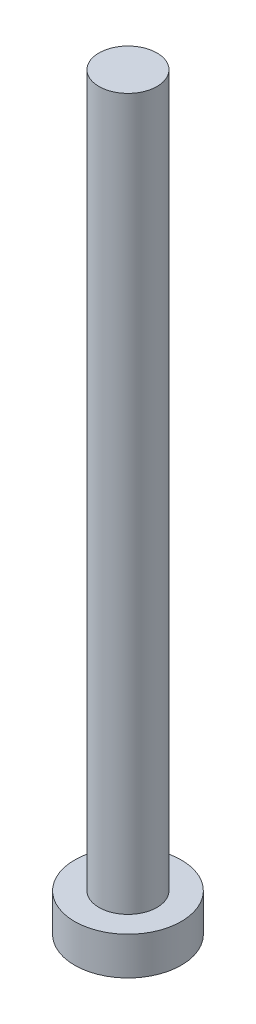
ISO-10303-21;
HEADER;
FILE_DESCRIPTION(('STEP AP214'),'2;1');
FILE_NAME('part.step','',(''),(''),'','','');
FILE_SCHEMA(('AUTOMOTIVE_DESIGN { 1 0 10303 214 1 1 1 1 }'));
ENDSEC;
DATA;
#1=APPLICATION_CONTEXT('core data for automotive mechanical design processes');
#2=APPLICATION_PROTOCOL_DEFINITION('international standard','automotive_design',2000,#1);
#3=PRODUCT_CONTEXT('',#1,'mechanical');
#4=PRODUCT('Part','Part','',(#3));
#5=PRODUCT_RELATED_PRODUCT_CATEGORY('part','',(#4));
#6=PRODUCT_DEFINITION_FORMATION('','',#4);
#7=PRODUCT_DEFINITION_CONTEXT('part definition',#1,'design');
#8=PRODUCT_DEFINITION('design','',#6,#7);
#9=PRODUCT_DEFINITION_SHAPE('','',#8);
#10=(LENGTH_UNIT() NAMED_UNIT(*) SI_UNIT(.MILLI.,.METRE.));
#11=(NAMED_UNIT(*) PLANE_ANGLE_UNIT() SI_UNIT($,.RADIAN.));
#12=(NAMED_UNIT(*) SI_UNIT($,.STERADIAN.) SOLID_ANGLE_UNIT());
#13=UNCERTAINTY_MEASURE_WITH_UNIT(LENGTH_MEASURE(1.E-05),#10,'distance_accuracy_value','');
#14=(GEOMETRIC_REPRESENTATION_CONTEXT(3) GLOBAL_UNCERTAINTY_ASSIGNED_CONTEXT((#13)) GLOBAL_UNIT_ASSIGNED_CONTEXT((#10,
#11,#12)) REPRESENTATION_CONTEXT('',''));
#15=CARTESIAN_POINT('',(0.,0.,0.));
#16=DIRECTION('',(0.,0.,1.));
#17=DIRECTION('',(1.,0.,0.));
#18=AXIS2_PLACEMENT_3D('',#15,#16,#17);
#19=CARTESIAN_POINT('',(0.,1.6,0.));
#20=DIRECTION('',(0.,-1.,0.));
#21=DIRECTION('',(0.,0.,-1.));
#22=AXIS2_PLACEMENT_3D('',#19,#20,#21);
#23=CYLINDRICAL_SURFACE('',#22,2.25);
#24=CARTESIAN_POINT('',(0.,1.6,0.));
#25=DIRECTION('',(0.,1.,0.));
#26=DIRECTION('',(0.,0.,1.));
#27=AXIS2_PLACEMENT_3D('',#24,#25,#26);
#28=CIRCLE('',#27,2.25);
#29=CARTESIAN_POINT('',(0.,1.6,2.25));
#30=VERTEX_POINT('',#29);
#31=EDGE_CURVE('E38',#30,#30,#28,.T.);
#32=ORIENTED_EDGE('',*,*,#31,.F.);
#33=EDGE_LOOP('',(#32));
#34=FACE_BOUND('',#33,.T.);
#35=CARTESIAN_POINT('',(0.,0.,0.));
#36=DIRECTION('',(0.,1.,0.));
#37=DIRECTION('',(0.,0.,1.));
#38=AXIS2_PLACEMENT_3D('',#35,#36,#37);
#39=CIRCLE('',#38,2.25);
#40=CARTESIAN_POINT('',(0.,0.,2.25));
#41=VERTEX_POINT('',#40);
#42=EDGE_CURVE('E34',#41,#41,#39,.T.);
#43=ORIENTED_EDGE('',*,*,#42,.T.);
#44=EDGE_LOOP('',(#43));
#45=FACE_BOUND('',#44,.T.);
#46=ADVANCED_FACE('F31',(#34,#45),#23,.T.);
#47=CARTESIAN_POINT('',(0.,1.6,0.));
#48=DIRECTION('',(0.,1.,0.));
#49=DIRECTION('',(0.,0.,1.));
#50=AXIS2_PLACEMENT_3D('',#47,#48,#49);
#51=PLANE('',#50);
#52=CARTESIAN_POINT('',(0.,1.6,0.));
#53=DIRECTION('',(0.,1.,0.));
#54=DIRECTION('',(0.,0.,1.));
#55=AXIS2_PLACEMENT_3D('',#52,#53,#54);
#56=CIRCLE('',#55,1.225);
#57=CARTESIAN_POINT('',(0.,1.6,1.225));
#58=VERTEX_POINT('',#57);
#59=EDGE_CURVE('E10',#58,#58,#56,.T.);
#60=ORIENTED_EDGE('',*,*,#59,.F.);
#61=EDGE_LOOP('',(#60));
#62=FACE_BOUND('',#61,.T.);
#63=ORIENTED_EDGE('',*,*,#31,.T.);
#64=EDGE_LOOP('',(#63));
#65=FACE_BOUND('',#64,.T.);
#66=ADVANCED_FACE('F55',(#62,#65),#51,.T.);
#67=CARTESIAN_POINT('',(0.,0.,0.));
#68=DIRECTION('',(0.,1.,0.));
#69=DIRECTION('',(0.,0.,1.));
#70=AXIS2_PLACEMENT_3D('',#67,#68,#69);
#71=PLANE('',#70);
#72=ORIENTED_EDGE('',*,*,#42,.F.);
#73=EDGE_LOOP('',(#72));
#74=FACE_BOUND('',#73,.T.);
#75=ADVANCED_FACE('F52',(#74),#71,.F.);
#76=CARTESIAN_POINT('',(0.,31.6,0.));
#77=DIRECTION('',(0.,-1.,0.));
#78=DIRECTION('',(0.,0.,-1.));
#79=AXIS2_PLACEMENT_3D('',#76,#77,#78);
#80=CYLINDRICAL_SURFACE('',#79,1.225);
#81=CARTESIAN_POINT('',(0.,31.6,0.));
#82=DIRECTION('',(0.,1.,0.));
#83=DIRECTION('',(0.,0.,1.));
#84=AXIS2_PLACEMENT_3D('',#81,#82,#83);
#85=CIRCLE('',#84,1.225);
#86=CARTESIAN_POINT('',(0.,31.6,1.225));
#87=VERTEX_POINT('',#86);
#88=EDGE_CURVE('E44',#87,#87,#85,.T.);
#89=ORIENTED_EDGE('',*,*,#88,.F.);
#90=EDGE_LOOP('',(#89));
#91=FACE_BOUND('',#90,.T.);
#92=ORIENTED_EDGE('',*,*,#59,.T.);
#93=EDGE_LOOP('',(#92));
#94=FACE_BOUND('',#93,.T.);
#95=ADVANCED_FACE('F54',(#91,#94),#80,.T.);
#96=CARTESIAN_POINT('',(0.,31.6,0.));
#97=DIRECTION('',(0.,1.,0.));
#98=DIRECTION('',(0.,0.,1.));
#99=AXIS2_PLACEMENT_3D('',#96,#97,#98);
#100=PLANE('',#99);
#101=ORIENTED_EDGE('',*,*,#88,.T.);
#102=EDGE_LOOP('',(#101));
#103=FACE_BOUND('',#102,.T.);
#104=ADVANCED_FACE('F60',(#103),#100,.T.);
#105=CLOSED_SHELL('',(#46,#66,#75,#95,#104));
#106=MANIFOLD_SOLID_BREP('B2',#105);
#107=ADVANCED_BREP_SHAPE_REPRESENTATION('',(#18,#106),#14);
#108=SHAPE_DEFINITION_REPRESENTATION(#9,#107);
ENDSEC;
END-ISO-10303-21;
